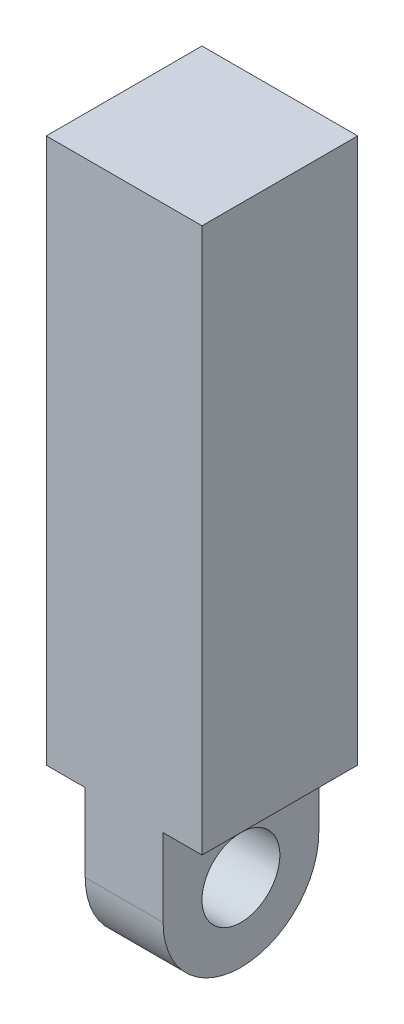
ISO-10303-21;
HEADER;
FILE_DESCRIPTION(('STEP AP214'),'2;1');
FILE_NAME('part.step','',(''),(''),'','','');
FILE_SCHEMA(('AUTOMOTIVE_DESIGN { 1 0 10303 214 1 1 1 1 }'));
ENDSEC;
DATA;
#1=APPLICATION_CONTEXT('core data for automotive mechanical design processes');
#2=APPLICATION_PROTOCOL_DEFINITION('international standard','automotive_design',2000,#1);
#3=PRODUCT_CONTEXT('',#1,'mechanical');
#4=PRODUCT('Part','Part','',(#3));
#5=PRODUCT_RELATED_PRODUCT_CATEGORY('part','',(#4));
#6=PRODUCT_DEFINITION_FORMATION('','',#4);
#7=PRODUCT_DEFINITION_CONTEXT('part definition',#1,'design');
#8=PRODUCT_DEFINITION('design','',#6,#7);
#9=PRODUCT_DEFINITION_SHAPE('','',#8);
#10=(LENGTH_UNIT() NAMED_UNIT(*) SI_UNIT(.MILLI.,.METRE.));
#11=(NAMED_UNIT(*) PLANE_ANGLE_UNIT() SI_UNIT($,.RADIAN.));
#12=(NAMED_UNIT(*) SI_UNIT($,.STERADIAN.) SOLID_ANGLE_UNIT());
#13=UNCERTAINTY_MEASURE_WITH_UNIT(LENGTH_MEASURE(1.E-05),#10,'distance_accuracy_value','');
#14=(GEOMETRIC_REPRESENTATION_CONTEXT(3) GLOBAL_UNCERTAINTY_ASSIGNED_CONTEXT((#13)) GLOBAL_UNIT_ASSIGNED_CONTEXT((#10,
#11,#12)) REPRESENTATION_CONTEXT('',''));
#15=CARTESIAN_POINT('',(0.,0.,0.));
#16=DIRECTION('',(0.,0.,1.));
#17=DIRECTION('',(1.,0.,0.));
#18=AXIS2_PLACEMENT_3D('',#15,#16,#17);
#19=CARTESIAN_POINT('',(50.8,457.2,50.8));
#20=DIRECTION('',(-1.,0.,0.));
#21=DIRECTION('',(0.,0.,1.));
#22=AXIS2_PLACEMENT_3D('',#19,#20,#21);
#23=PLANE('',#22);
#24=DIRECTION('',(0.,-1.,0.));
#25=VECTOR('',#24,1.);
#26=CARTESIAN_POINT('',(50.8,457.2,50.8));
#27=LINE('',#26,#25);
#28=CARTESIAN_POINT('',(50.8,457.2,50.8));
#29=VERTEX_POINT('',#28);
#30=CARTESIAN_POINT('',(50.8,101.6,50.8));
#31=VERTEX_POINT('',#30);
#32=EDGE_CURVE('E162',#29,#31,#27,.T.);
#33=ORIENTED_EDGE('',*,*,#32,.T.);
#34=DIRECTION('',(0.,0.,1.));
#35=VECTOR('',#34,1.);
#36=CARTESIAN_POINT('',(50.8,101.6,-50.8));
#37=LINE('',#36,#35);
#38=CARTESIAN_POINT('',(50.8,101.6,-50.8));
#39=VERTEX_POINT('',#38);
#40=EDGE_CURVE('E141',#39,#31,#37,.T.);
#41=ORIENTED_EDGE('',*,*,#40,.F.);
#42=DIRECTION('',(0.,-1.,0.));
#43=VECTOR('',#42,1.);
#44=CARTESIAN_POINT('',(50.8,457.2,-50.8));
#45=LINE('',#44,#43);
#46=CARTESIAN_POINT('',(50.8,457.2,-50.8));
#47=VERTEX_POINT('',#46);
#48=EDGE_CURVE('E170',#47,#39,#45,.T.);
#49=ORIENTED_EDGE('',*,*,#48,.F.);
#50=DIRECTION('',(0.,0.,-1.));
#51=VECTOR('',#50,1.);
#52=CARTESIAN_POINT('',(50.8,457.2,50.8));
#53=LINE('',#52,#51);
#54=EDGE_CURVE('E139',#29,#47,#53,.T.);
#55=ORIENTED_EDGE('',*,*,#54,.F.);
#56=EDGE_LOOP('',(#33,#41,#49,#55));
#57=FACE_BOUND('',#56,.T.);
#58=ADVANCED_FACE('F37',(#57),#23,.F.);
#59=CARTESIAN_POINT('',(-50.8,457.2,-50.8));
#60=DIRECTION('',(0.,0.,1.));
#61=DIRECTION('',(1.,0.,0.));
#62=AXIS2_PLACEMENT_3D('',#59,#60,#61);
#63=PLANE('',#62);
#64=DIRECTION('',(0.,-1.,0.));
#65=VECTOR('',#64,1.);
#66=CARTESIAN_POINT('',(25.4,0.,-50.8));
#67=LINE('',#66,#65);
#68=CARTESIAN_POINT('',(25.4,101.6,-50.8));
#69=VERTEX_POINT('',#68);
#70=CARTESIAN_POINT('',(25.4,50.8,-50.8));
#71=VERTEX_POINT('',#70);
#72=EDGE_CURVE('E143',#69,#71,#67,.T.);
#73=ORIENTED_EDGE('',*,*,#72,.T.);
#74=DIRECTION('',(-1.,0.,0.));
#75=VECTOR('',#74,1.);
#76=CARTESIAN_POINT('',(-25.4,50.8,-50.8));
#77=LINE('',#76,#75);
#78=CARTESIAN_POINT('',(-25.4,50.8,-50.8));
#79=VERTEX_POINT('',#78);
#80=EDGE_CURVE('E119',#71,#79,#77,.T.);
#81=ORIENTED_EDGE('',*,*,#80,.T.);
#82=DIRECTION('',(0.,1.,0.));
#83=VECTOR('',#82,1.);
#84=CARTESIAN_POINT('',(-25.4,0.,-50.8));
#85=LINE('',#84,#83);
#86=CARTESIAN_POINT('',(-25.4,101.6,-50.8));
#87=VERTEX_POINT('',#86);
#88=EDGE_CURVE('E110',#79,#87,#85,.T.);
#89=ORIENTED_EDGE('',*,*,#88,.T.);
#90=DIRECTION('',(-1.,0.,0.));
#91=VECTOR('',#90,1.);
#92=CARTESIAN_POINT('',(-50.8,101.6,-50.8));
#93=LINE('',#92,#91);
#94=CARTESIAN_POINT('',(-50.8,101.6,-50.8));
#95=VERTEX_POINT('',#94);
#96=EDGE_CURVE('E116',#87,#95,#93,.T.);
#97=ORIENTED_EDGE('',*,*,#96,.T.);
#98=DIRECTION('',(0.,-1.,0.));
#99=VECTOR('',#98,1.);
#100=CARTESIAN_POINT('',(-50.8,457.2,-50.8));
#101=LINE('',#100,#99);
#102=CARTESIAN_POINT('',(-50.8,457.2,-50.8));
#103=VERTEX_POINT('',#102);
#104=EDGE_CURVE('E168',#103,#95,#101,.T.);
#105=ORIENTED_EDGE('',*,*,#104,.F.);
#106=DIRECTION('',(-1.,0.,0.));
#107=VECTOR('',#106,1.);
#108=CARTESIAN_POINT('',(-50.8,457.2,-50.8));
#109=LINE('',#108,#107);
#110=EDGE_CURVE('E156',#47,#103,#109,.T.);
#111=ORIENTED_EDGE('',*,*,#110,.F.);
#112=ORIENTED_EDGE('',*,*,#48,.T.);
#113=DIRECTION('',(-1.,0.,0.));
#114=VECTOR('',#113,1.);
#115=CARTESIAN_POINT('',(50.8,101.6,-50.8));
#116=LINE('',#115,#114);
#117=EDGE_CURVE('E148',#39,#69,#116,.T.);
#118=ORIENTED_EDGE('',*,*,#117,.T.);
#119=EDGE_LOOP('',(#73,#81,#89,#97,#105,#111,#112,#118));
#120=FACE_BOUND('',#119,.T.);
#121=ADVANCED_FACE('F113',(#120),#63,.F.);
#122=CARTESIAN_POINT('',(-50.8,457.2,50.8));
#123=DIRECTION('',(1.,0.,0.));
#124=DIRECTION('',(0.,0.,-1.));
#125=AXIS2_PLACEMENT_3D('',#122,#123,#124);
#126=PLANE('',#125);
#127=ORIENTED_EDGE('',*,*,#104,.T.);
#128=DIRECTION('',(0.,0.,1.));
#129=VECTOR('',#128,1.);
#130=CARTESIAN_POINT('',(-50.8,101.6,-50.8));
#131=LINE('',#130,#129);
#132=CARTESIAN_POINT('',(-50.8,101.6,50.8));
#133=VERTEX_POINT('',#132);
#134=EDGE_CURVE('E129',#95,#133,#131,.T.);
#135=ORIENTED_EDGE('',*,*,#134,.T.);
#136=DIRECTION('',(0.,-1.,0.));
#137=VECTOR('',#136,1.);
#138=CARTESIAN_POINT('',(-50.8,457.2,50.8));
#139=LINE('',#138,#137);
#140=CARTESIAN_POINT('',(-50.8,457.2,50.8));
#141=VERTEX_POINT('',#140);
#142=EDGE_CURVE('E165',#141,#133,#139,.T.);
#143=ORIENTED_EDGE('',*,*,#142,.F.);
#144=DIRECTION('',(0.,0.,1.));
#145=VECTOR('',#144,1.);
#146=CARTESIAN_POINT('',(-50.8,457.2,50.8));
#147=LINE('',#146,#145);
#148=EDGE_CURVE('E158',#103,#141,#147,.T.);
#149=ORIENTED_EDGE('',*,*,#148,.F.);
#150=EDGE_LOOP('',(#127,#135,#143,#149));
#151=FACE_BOUND('',#150,.T.);
#152=ADVANCED_FACE('F214',(#151),#126,.F.);
#153=CARTESIAN_POINT('',(-50.8,457.2,50.8));
#154=DIRECTION('',(0.,0.,-1.));
#155=DIRECTION('',(-1.,0.,0.));
#156=AXIS2_PLACEMENT_3D('',#153,#154,#155);
#157=PLANE('',#156);
#158=DIRECTION('',(0.,1.,0.));
#159=VECTOR('',#158,1.);
#160=CARTESIAN_POINT('',(-25.4,0.,50.8));
#161=LINE('',#160,#159);
#162=CARTESIAN_POINT('',(-25.4,50.8,50.8));
#163=VERTEX_POINT('',#162);
#164=CARTESIAN_POINT('',(-25.4,101.6,50.8));
#165=VERTEX_POINT('',#164);
#166=EDGE_CURVE('E126',#163,#165,#161,.T.);
#167=ORIENTED_EDGE('',*,*,#166,.F.);
#168=DIRECTION('',(1.,0.,0.));
#169=VECTOR('',#168,1.);
#170=CARTESIAN_POINT('',(25.4,50.8,50.8));
#171=LINE('',#170,#169);
#172=CARTESIAN_POINT('',(25.4,50.8,50.8));
#173=VERTEX_POINT('',#172);
#174=EDGE_CURVE('E11',#163,#173,#171,.T.);
#175=ORIENTED_EDGE('',*,*,#174,.T.);
#176=DIRECTION('',(0.,-1.,0.));
#177=VECTOR('',#176,1.);
#178=CARTESIAN_POINT('',(25.4,0.,50.8));
#179=LINE('',#178,#177);
#180=CARTESIAN_POINT('',(25.4,101.6,50.8));
#181=VERTEX_POINT('',#180);
#182=EDGE_CURVE('E146',#181,#173,#179,.T.);
#183=ORIENTED_EDGE('',*,*,#182,.F.);
#184=DIRECTION('',(-1.,0.,0.));
#185=VECTOR('',#184,1.);
#186=CARTESIAN_POINT('',(50.8,101.6,50.8));
#187=LINE('',#186,#185);
#188=EDGE_CURVE('E137',#31,#181,#187,.T.);
#189=ORIENTED_EDGE('',*,*,#188,.F.);
#190=ORIENTED_EDGE('',*,*,#32,.F.);
#191=DIRECTION('',(1.,0.,0.));
#192=VECTOR('',#191,1.);
#193=CARTESIAN_POINT('',(-50.8,457.2,50.8));
#194=LINE('',#193,#192);
#195=EDGE_CURVE('E160',#141,#29,#194,.T.);
#196=ORIENTED_EDGE('',*,*,#195,.F.);
#197=ORIENTED_EDGE('',*,*,#142,.T.);
#198=DIRECTION('',(-1.,0.,0.));
#199=VECTOR('',#198,1.);
#200=CARTESIAN_POINT('',(-50.8,101.6,50.8));
#201=LINE('',#200,#199);
#202=EDGE_CURVE('E121',#165,#133,#201,.T.);
#203=ORIENTED_EDGE('',*,*,#202,.F.);
#204=EDGE_LOOP('',(#167,#175,#183,#189,#190,#196,#197,#203));
#205=FACE_BOUND('',#204,.T.);
#206=ADVANCED_FACE('F262',(#205),#157,.F.);
#207=CARTESIAN_POINT('',(0.,457.2,0.));
#208=DIRECTION('',(0.,-1.,0.));
#209=DIRECTION('',(0.,0.,-1.));
#210=AXIS2_PLACEMENT_3D('',#207,#208,#209);
#211=PLANE('',#210);
#212=ORIENTED_EDGE('',*,*,#54,.T.);
#213=ORIENTED_EDGE('',*,*,#110,.T.);
#214=ORIENTED_EDGE('',*,*,#148,.T.);
#215=ORIENTED_EDGE('',*,*,#195,.T.);
#216=EDGE_LOOP('',(#212,#213,#214,#215));
#217=FACE_BOUND('',#216,.T.);
#218=ADVANCED_FACE('F241',(#217),#211,.F.);
#219=CARTESIAN_POINT('',(25.4,0.,-50.8));
#220=DIRECTION('',(-1.,0.,0.));
#221=DIRECTION('',(0.,0.,1.));
#222=AXIS2_PLACEMENT_3D('',#219,#220,#221);
#223=PLANE('',#222);
#224=CARTESIAN_POINT('',(25.4,50.8,0.));
#225=DIRECTION('',(-1.,0.,0.));
#226=DIRECTION('',(0.,0.,1.));
#227=AXIS2_PLACEMENT_3D('',#224,#225,#226);
#228=CIRCLE('',#227,25.4);
#229=CARTESIAN_POINT('',(25.4,50.8,25.4));
#230=VERTEX_POINT('',#229);
#231=EDGE_CURVE('E187',#230,#230,#228,.T.);
#232=ORIENTED_EDGE('',*,*,#231,.T.);
#233=EDGE_LOOP('',(#232));
#234=FACE_BOUND('',#233,.T.);
#235=CARTESIAN_POINT('',(25.4,50.8,0.));
#236=DIRECTION('',(-1.,0.,0.));
#237=DIRECTION('',(0.,0.,1.));
#238=AXIS2_PLACEMENT_3D('',#235,#236,#237);
#239=CIRCLE('',#238,50.8);
#240=CARTESIAN_POINT('',(25.4,0.,0.));
#241=VERTEX_POINT('',#240);
#242=EDGE_CURVE('E53',#173,#241,#239,.F.);
#243=ORIENTED_EDGE('',*,*,#242,.T.);
#244=CARTESIAN_POINT('',(25.4,50.8,0.));
#245=DIRECTION('',(-1.,0.,0.));
#246=DIRECTION('',(0.,0.,1.));
#247=AXIS2_PLACEMENT_3D('',#244,#245,#246);
#248=CIRCLE('',#247,50.8);
#249=EDGE_CURVE('E46',#241,#71,#248,.F.);
#250=ORIENTED_EDGE('',*,*,#249,.T.);
#251=ORIENTED_EDGE('',*,*,#72,.F.);
#252=DIRECTION('',(0.,0.,1.));
#253=VECTOR('',#252,1.);
#254=CARTESIAN_POINT('',(25.4,101.6,-50.8));
#255=LINE('',#254,#253);
#256=EDGE_CURVE('E144',#69,#181,#255,.T.);
#257=ORIENTED_EDGE('',*,*,#256,.T.);
#258=ORIENTED_EDGE('',*,*,#182,.T.);
#259=EDGE_LOOP('',(#243,#250,#251,#257,#258));
#260=FACE_BOUND('',#259,.T.);
#261=ADVANCED_FACE('F181',(#234,#260),#223,.F.);
#262=CARTESIAN_POINT('',(50.8,101.6,-50.8));
#263=DIRECTION('',(0.,1.,0.));
#264=DIRECTION('',(0.,0.,1.));
#265=AXIS2_PLACEMENT_3D('',#262,#263,#264);
#266=PLANE('',#265);
#267=ORIENTED_EDGE('',*,*,#188,.T.);
#268=ORIENTED_EDGE('',*,*,#256,.F.);
#269=ORIENTED_EDGE('',*,*,#117,.F.);
#270=ORIENTED_EDGE('',*,*,#40,.T.);
#271=EDGE_LOOP('',(#267,#268,#269,#270));
#272=FACE_BOUND('',#271,.T.);
#273=ADVANCED_FACE('F205',(#272),#266,.F.);
#274=CARTESIAN_POINT('',(-50.8,101.6,-50.8));
#275=DIRECTION('',(0.,1.,0.));
#276=DIRECTION('',(0.,0.,1.));
#277=AXIS2_PLACEMENT_3D('',#274,#275,#276);
#278=PLANE('',#277);
#279=ORIENTED_EDGE('',*,*,#202,.T.);
#280=ORIENTED_EDGE('',*,*,#134,.F.);
#281=ORIENTED_EDGE('',*,*,#96,.F.);
#282=DIRECTION('',(0.,0.,1.));
#283=VECTOR('',#282,1.);
#284=CARTESIAN_POINT('',(-25.4,101.6,-50.8));
#285=LINE('',#284,#283);
#286=EDGE_CURVE('E124',#87,#165,#285,.T.);
#287=ORIENTED_EDGE('',*,*,#286,.T.);
#288=EDGE_LOOP('',(#279,#280,#281,#287));
#289=FACE_BOUND('',#288,.T.);
#290=ADVANCED_FACE('F131',(#289),#278,.F.);
#291=CARTESIAN_POINT('',(-25.4,0.,-50.8));
#292=DIRECTION('',(1.,0.,0.));
#293=DIRECTION('',(0.,0.,-1.));
#294=AXIS2_PLACEMENT_3D('',#291,#292,#293);
#295=PLANE('',#294);
#296=CARTESIAN_POINT('',(-25.4,50.8,0.));
#297=DIRECTION('',(-1.,0.,0.));
#298=DIRECTION('',(0.,0.,1.));
#299=AXIS2_PLACEMENT_3D('',#296,#297,#298);
#300=CIRCLE('',#299,25.4);
#301=CARTESIAN_POINT('',(-25.4,50.8,25.4));
#302=VERTEX_POINT('',#301);
#303=EDGE_CURVE('E189',#302,#302,#300,.T.);
#304=ORIENTED_EDGE('',*,*,#303,.F.);
#305=EDGE_LOOP('',(#304));
#306=FACE_BOUND('',#305,.T.);
#307=ORIENTED_EDGE('',*,*,#88,.F.);
#308=CARTESIAN_POINT('',(-25.4,50.8,0.));
#309=DIRECTION('',(1.,0.,0.));
#310=DIRECTION('',(0.,0.,-1.));
#311=AXIS2_PLACEMENT_3D('',#308,#309,#310);
#312=CIRCLE('',#311,50.8);
#313=CARTESIAN_POINT('',(-25.4,0.,0.));
#314=VERTEX_POINT('',#313);
#315=EDGE_CURVE('E176',#79,#314,#312,.F.);
#316=ORIENTED_EDGE('',*,*,#315,.T.);
#317=CARTESIAN_POINT('',(-25.4,50.8,0.));
#318=DIRECTION('',(1.,0.,0.));
#319=DIRECTION('',(0.,0.,-1.));
#320=AXIS2_PLACEMENT_3D('',#317,#318,#319);
#321=CIRCLE('',#320,50.8);
#322=EDGE_CURVE('E174',#314,#163,#321,.F.);
#323=ORIENTED_EDGE('',*,*,#322,.T.);
#324=ORIENTED_EDGE('',*,*,#166,.T.);
#325=ORIENTED_EDGE('',*,*,#286,.F.);
#326=EDGE_LOOP('',(#307,#316,#323,#324,#325));
#327=FACE_BOUND('',#326,.T.);
#328=ADVANCED_FACE('F125',(#306,#327),#295,.F.);
#329=CARTESIAN_POINT('',(-50.8,50.8,0.));
#330=DIRECTION('',(-1.,0.,0.));
#331=DIRECTION('',(0.,0.,1.));
#332=AXIS2_PLACEMENT_3D('',#329,#330,#331);
#333=CYLINDRICAL_SURFACE('',#332,50.8);
#334=DIRECTION('',(1.,0.,0.));
#335=VECTOR('',#334,1.);
#336=CARTESIAN_POINT('',(-25.4,0.,0.));
#337=LINE('',#336,#335);
#338=EDGE_CURVE('E41',#241,#314,#337,.F.);
#339=ORIENTED_EDGE('',*,*,#338,.F.);
#340=ORIENTED_EDGE('',*,*,#242,.F.);
#341=ORIENTED_EDGE('',*,*,#174,.F.);
#342=ORIENTED_EDGE('',*,*,#322,.F.);
#343=EDGE_LOOP('',(#339,#340,#341,#342));
#344=FACE_BOUND('',#343,.T.);
#345=ADVANCED_FACE('F39',(#344),#333,.T.);
#346=CARTESIAN_POINT('',(-50.8,50.8,0.));
#347=DIRECTION('',(1.,0.,0.));
#348=DIRECTION('',(0.,0.,-1.));
#349=AXIS2_PLACEMENT_3D('',#346,#347,#348);
#350=CYLINDRICAL_SURFACE('',#349,50.8);
#351=ORIENTED_EDGE('',*,*,#249,.F.);
#352=ORIENTED_EDGE('',*,*,#338,.T.);
#353=ORIENTED_EDGE('',*,*,#315,.F.);
#354=ORIENTED_EDGE('',*,*,#80,.F.);
#355=EDGE_LOOP('',(#351,#352,#353,#354));
#356=FACE_BOUND('',#355,.T.);
#357=ADVANCED_FACE('F184',(#356),#350,.T.);
#358=CARTESIAN_POINT('',(50.8,50.8,0.));
#359=DIRECTION('',(-1.,0.,0.));
#360=DIRECTION('',(0.,0.,1.));
#361=AXIS2_PLACEMENT_3D('',#358,#359,#360);
#362=CYLINDRICAL_SURFACE('',#361,25.4);
#363=ORIENTED_EDGE('',*,*,#303,.T.);
#364=EDGE_LOOP('',(#363));
#365=FACE_BOUND('',#364,.T.);
#366=ORIENTED_EDGE('',*,*,#231,.F.);
#367=EDGE_LOOP('',(#366));
#368=FACE_BOUND('',#367,.T.);
#369=ADVANCED_FACE('F196',(#365,#368),#362,.F.);
#370=CLOSED_SHELL('',(#58,#121,#152,#206,#218,#261,#273,#290,#328,#345,#357,#369));
#371=MANIFOLD_SOLID_BREP('B2',#370);
#372=ADVANCED_BREP_SHAPE_REPRESENTATION('',(#18,#371),#14);
#373=SHAPE_DEFINITION_REPRESENTATION(#9,#372);
ENDSEC;
END-ISO-10303-21;
